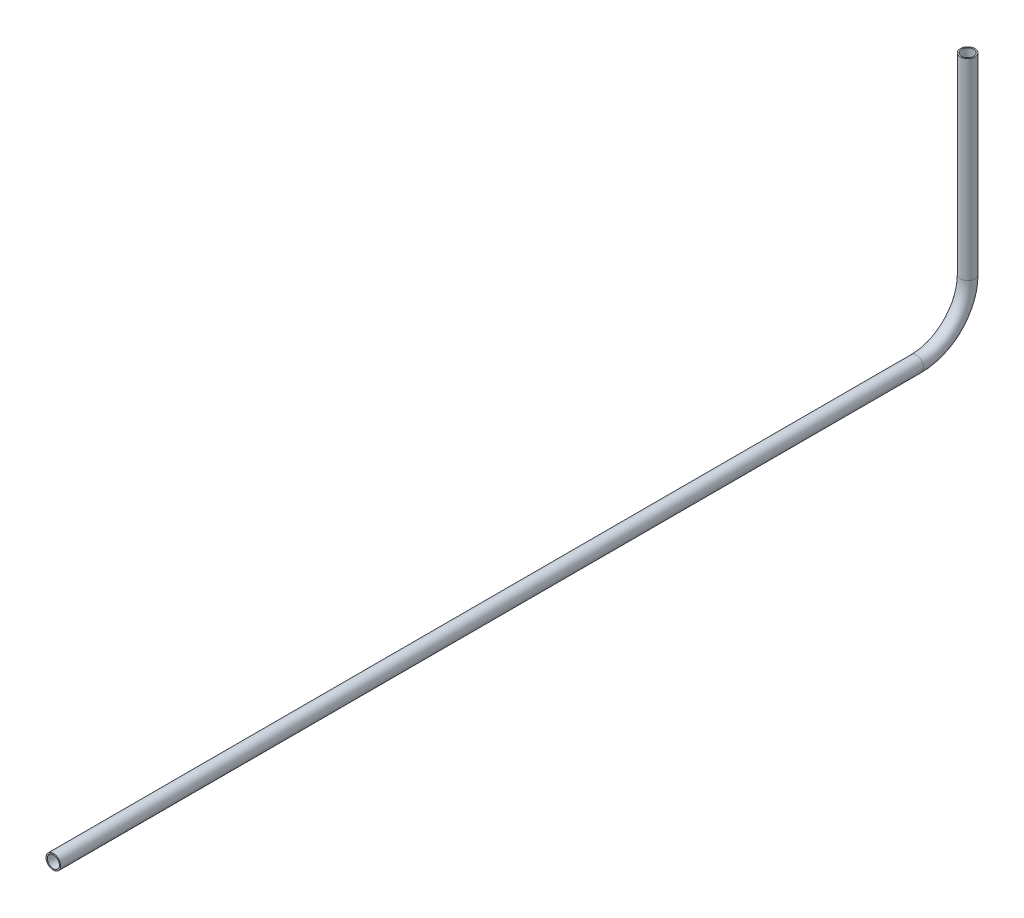
ISO-10303-21;
HEADER;
FILE_DESCRIPTION(('STEP AP214'),'2;1');
FILE_NAME('part.step','',(''),(''),'','','');
FILE_SCHEMA(('AUTOMOTIVE_DESIGN { 1 0 10303 214 1 1 1 1 }'));
ENDSEC;
DATA;
#1=APPLICATION_CONTEXT('core data for automotive mechanical design processes');
#2=APPLICATION_PROTOCOL_DEFINITION('international standard','automotive_design',2000,#1);
#3=PRODUCT_CONTEXT('',#1,'mechanical');
#4=PRODUCT('Part','Part','',(#3));
#5=PRODUCT_RELATED_PRODUCT_CATEGORY('part','',(#4));
#6=PRODUCT_DEFINITION_FORMATION('','',#4);
#7=PRODUCT_DEFINITION_CONTEXT('part definition',#1,'design');
#8=PRODUCT_DEFINITION('design','',#6,#7);
#9=PRODUCT_DEFINITION_SHAPE('','',#8);
#10=(LENGTH_UNIT() NAMED_UNIT(*) SI_UNIT(.MILLI.,.METRE.));
#11=(NAMED_UNIT(*) PLANE_ANGLE_UNIT() SI_UNIT($,.RADIAN.));
#12=(NAMED_UNIT(*) SI_UNIT($,.STERADIAN.) SOLID_ANGLE_UNIT());
#13=UNCERTAINTY_MEASURE_WITH_UNIT(LENGTH_MEASURE(1.E-05),#10,'distance_accuracy_value','');
#14=(GEOMETRIC_REPRESENTATION_CONTEXT(3) GLOBAL_UNCERTAINTY_ASSIGNED_CONTEXT((#13)) GLOBAL_UNIT_ASSIGNED_CONTEXT((#10,
#11,#12)) REPRESENTATION_CONTEXT('',''));
#15=CARTESIAN_POINT('',(0.,0.,0.));
#16=DIRECTION('',(0.,0.,1.));
#17=DIRECTION('',(1.,0.,0.));
#18=AXIS2_PLACEMENT_3D('',#15,#16,#17);
#19=CARTESIAN_POINT('',(0.,192.006959967836,-131.117091872553));
#20=DIRECTION('',(0.,0.,1.));
#21=DIRECTION('',(0.,-1.,0.));
#22=AXIS2_PLACEMENT_3D('',#19,#20,#21);
#23=CYLINDRICAL_SURFACE('',#22,2.61619999999999);
#24=CARTESIAN_POINT('',(0.,192.006959967836,242.917619127408));
#25=DIRECTION('',(0.,0.,-1.));
#26=DIRECTION('',(0.,1.,0.));
#27=AXIS2_PLACEMENT_3D('',#24,#25,#26);
#28=CIRCLE('',#27,2.61619999999999);
#29=CARTESIAN_POINT('',(0.,194.623159967836,242.917619127408));
#30=VERTEX_POINT('',#29);
#31=EDGE_CURVE('E55',#30,#30,#28,.T.);
#32=ORIENTED_EDGE('',*,*,#31,.F.);
#33=EDGE_LOOP('',(#32));
#34=FACE_BOUND('',#33,.T.);
#35=CARTESIAN_POINT('',(0.,192.006959967836,-131.117091872553));
#36=DIRECTION('',(0.,0.,-1.));
#37=DIRECTION('',(0.,1.,0.));
#38=AXIS2_PLACEMENT_3D('',#35,#36,#37);
#39=CIRCLE('',#38,2.61619999999999);
#40=CARTESIAN_POINT('',(0.,194.623159967836,-131.117091872553));
#41=VERTEX_POINT('',#40);
#42=EDGE_CURVE('E51',#41,#41,#39,.T.);
#43=ORIENTED_EDGE('',*,*,#42,.T.);
#44=EDGE_LOOP('',(#43));
#45=FACE_BOUND('',#44,.T.);
#46=ADVANCED_FACE('F47',(#34,#45),#23,.F.);
#47=CARTESIAN_POINT('',(0.,192.006959967836,-131.117091872553));
#48=DIRECTION('',(0.,0.,1.));
#49=DIRECTION('',(0.,-1.,0.));
#50=AXIS2_PLACEMENT_3D('',#47,#48,#49);
#51=CYLINDRICAL_SURFACE('',#50,3.175);
#52=CARTESIAN_POINT('',(0.,192.006959967836,242.917619127408));
#53=DIRECTION('',(0.,0.,-1.));
#54=DIRECTION('',(0.,1.,0.));
#55=AXIS2_PLACEMENT_3D('',#52,#53,#54);
#56=CIRCLE('',#55,3.175);
#57=CARTESIAN_POINT('',(0.,195.181959967836,242.917619127408));
#58=VERTEX_POINT('',#57);
#59=EDGE_CURVE('E59',#58,#58,#56,.T.);
#60=ORIENTED_EDGE('',*,*,#59,.T.);
#61=EDGE_LOOP('',(#60));
#62=FACE_BOUND('',#61,.T.);
#63=CARTESIAN_POINT('',(0.,192.006959967836,-131.117091872553));
#64=DIRECTION('',(0.,0.,-1.));
#65=DIRECTION('',(0.,1.,0.));
#66=AXIS2_PLACEMENT_3D('',#63,#64,#65);
#67=CIRCLE('',#66,3.175);
#68=CARTESIAN_POINT('',(0.,195.181959967836,-131.117091872553));
#69=VERTEX_POINT('',#68);
#70=EDGE_CURVE('E12',#69,#69,#67,.T.);
#71=ORIENTED_EDGE('',*,*,#70,.F.);
#72=EDGE_LOOP('',(#71));
#73=FACE_BOUND('',#72,.T.);
#74=ADVANCED_FACE('F74',(#62,#73),#51,.T.);
#75=CARTESIAN_POINT('',(0.,192.006959967836,242.917619127408));
#76=DIRECTION('',(0.,0.,-1.));
#77=DIRECTION('',(0.,1.,0.));
#78=AXIS2_PLACEMENT_3D('',#75,#76,#77);
#79=PLANE('',#78);
#80=ORIENTED_EDGE('',*,*,#31,.T.);
#81=EDGE_LOOP('',(#80));
#82=FACE_BOUND('',#81,.T.);
#83=ORIENTED_EDGE('',*,*,#59,.F.);
#84=EDGE_LOOP('',(#83));
#85=FACE_BOUND('',#84,.T.);
#86=ADVANCED_FACE('F70',(#82,#85),#79,.F.);
#87=CARTESIAN_POINT('',(0.,192.006959967836,-131.117091872553));
#88=DIRECTION('',(0.,0.,-1.));
#89=DIRECTION('',(0.,1.,0.));
#90=AXIS2_PLACEMENT_3D('',#87,#88,#89);
#91=PLANE('',#90);
#92=ORIENTED_EDGE('',*,*,#42,.F.);
#93=EDGE_LOOP('',(#92));
#94=FACE_BOUND('',#93,.T.);
#95=ORIENTED_EDGE('',*,*,#70,.T.);
#96=EDGE_LOOP('',(#95));
#97=FACE_BOUND('',#96,.T.);
#98=ADVANCED_FACE('F49',(#94,#97),#91,.T.);
#99=CLOSED_SHELL('',(#46,#74,#86,#98));
#100=MANIFOLD_SOLID_BREP('B2',#99);
#101=CARTESIAN_POINT('',(0.,214.231959967836,-131.117091872553));
#102=DIRECTION('',(-1.,0.,0.));
#103=DIRECTION('',(0.,0.,1.));
#104=AXIS2_PLACEMENT_3D('',#101,#102,#103);
#105=TOROIDAL_SURFACE('',#104,22.225,2.61619999999999);
#106=CARTESIAN_POINT('',(0.,214.231959967836,-153.342091872553));
#107=DIRECTION('',(0.,1.,0.));
#108=DIRECTION('',(0.,0.,1.));
#109=AXIS2_PLACEMENT_3D('',#106,#107,#108);
#110=CIRCLE('',#109,2.61619999999999);
#111=CARTESIAN_POINT('',(0.,214.231959967836,-155.958291872553));
#112=VERTEX_POINT('',#111);
#113=EDGE_CURVE('E150',#112,#112,#110,.T.);
#114=CARTESIAN_POINT('',(0.,192.006959967836,-131.117091872553));
#115=DIRECTION('',(0.,0.,1.));
#116=DIRECTION('',(0.,-1.,0.));
#117=AXIS2_PLACEMENT_3D('',#114,#115,#116);
#118=CIRCLE('',#117,2.61619999999999);
#119=CARTESIAN_POINT('',(0.,189.390759967836,-131.117091872553));
#120=VERTEX_POINT('',#119);
#121=EDGE_CURVE('E140',#120,#120,#118,.T.);
#122=CARTESIAN_POINT('',(0.,214.231959967836,-131.117091872553));
#123=DIRECTION('',(-1.,0.,0.));
#124=DIRECTION('',(0.,0.,1.));
#125=AXIS2_PLACEMENT_3D('',#122,#123,#124);
#126=CIRCLE('',#125,24.8412);
#127=EDGE_CURVE('',#112,#120,#126,.T.);
#128=ORIENTED_EDGE('',*,*,#113,.T.);
#129=ORIENTED_EDGE('',*,*,#121,.T.);
#130=ORIENTED_EDGE('',*,*,#127,.T.);
#131=ORIENTED_EDGE('',*,*,#127,.F.);
#132=EDGE_LOOP('',(#128,#130,#129,#131));
#133=FACE_BOUND('',#132,.T.);
#134=ADVANCED_FACE('F136',(#133),#105,.F.);
#135=CARTESIAN_POINT('',(0.,214.231959967836,-131.117091872553));
#136=DIRECTION('',(-1.,0.,0.));
#137=DIRECTION('',(0.,0.,1.));
#138=AXIS2_PLACEMENT_3D('',#135,#136,#137);
#139=TOROIDAL_SURFACE('',#138,22.225,3.175);
#140=CARTESIAN_POINT('',(0.,214.231959967836,-153.342091872553));
#141=DIRECTION('',(0.,1.,0.));
#142=DIRECTION('',(0.,0.,1.));
#143=AXIS2_PLACEMENT_3D('',#140,#141,#142);
#144=CIRCLE('',#143,3.175);
#145=CARTESIAN_POINT('',(0.,214.231959967836,-156.517091872553));
#146=VERTEX_POINT('',#145);
#147=EDGE_CURVE('E144',#146,#146,#144,.T.);
#148=CARTESIAN_POINT('',(0.,192.006959967836,-131.117091872553));
#149=DIRECTION('',(0.,0.,1.));
#150=DIRECTION('',(0.,-1.,0.));
#151=AXIS2_PLACEMENT_3D('',#148,#149,#150);
#152=CIRCLE('',#151,3.175);
#153=CARTESIAN_POINT('',(0.,188.831959967836,-131.117091872553));
#154=VERTEX_POINT('',#153);
#155=EDGE_CURVE('E46',#154,#154,#152,.T.);
#156=CARTESIAN_POINT('',(0.,214.231959967836,-131.117091872553));
#157=DIRECTION('',(-1.,0.,0.));
#158=DIRECTION('',(0.,0.,1.));
#159=AXIS2_PLACEMENT_3D('',#156,#157,#158);
#160=CIRCLE('',#159,25.4);
#161=EDGE_CURVE('',#146,#154,#160,.T.);
#162=ORIENTED_EDGE('',*,*,#147,.F.);
#163=ORIENTED_EDGE('',*,*,#155,.F.);
#164=ORIENTED_EDGE('',*,*,#161,.T.);
#165=ORIENTED_EDGE('',*,*,#161,.F.);
#166=EDGE_LOOP('',(#162,#164,#163,#165));
#167=FACE_BOUND('',#166,.T.);
#168=ADVANCED_FACE('F163',(#167),#139,.T.);
#169=CARTESIAN_POINT('',(0.,214.231959967836,-153.342091872553));
#170=DIRECTION('',(0.,1.,0.));
#171=DIRECTION('',(0.,0.,1.));
#172=AXIS2_PLACEMENT_3D('',#169,#170,#171);
#173=PLANE('',#172);
#174=ORIENTED_EDGE('',*,*,#113,.F.);
#175=EDGE_LOOP('',(#174));
#176=FACE_BOUND('',#175,.T.);
#177=ORIENTED_EDGE('',*,*,#147,.T.);
#178=EDGE_LOOP('',(#177));
#179=FACE_BOUND('',#178,.T.);
#180=ADVANCED_FACE('F159',(#176,#179),#173,.T.);
#181=CARTESIAN_POINT('',(0.,192.006959967836,-131.117091872553));
#182=DIRECTION('',(0.,0.,1.));
#183=DIRECTION('',(0.,-1.,0.));
#184=AXIS2_PLACEMENT_3D('',#181,#182,#183);
#185=PLANE('',#184);
#186=ORIENTED_EDGE('',*,*,#121,.F.);
#187=EDGE_LOOP('',(#186));
#188=FACE_BOUND('',#187,.T.);
#189=ORIENTED_EDGE('',*,*,#155,.T.);
#190=EDGE_LOOP('',(#189));
#191=FACE_BOUND('',#190,.T.);
#192=ADVANCED_FACE('F138',(#188,#191),#185,.T.);
#193=CLOSED_SHELL('',(#134,#168,#180,#192));
#194=MANIFOLD_SOLID_BREP('B7',#193);
#195=CARTESIAN_POINT('',(0.,297.527925577302,-153.342091872553));
#196=DIRECTION('',(0.,-1.,0.));
#197=DIRECTION('',(0.,0.,-1.));
#198=AXIS2_PLACEMENT_3D('',#195,#196,#197);
#199=CYLINDRICAL_SURFACE('',#198,2.61619999999999);
#200=CARTESIAN_POINT('',(0.,297.527925577302,-153.342091872553));
#201=DIRECTION('',(0.,1.,0.));
#202=DIRECTION('',(0.,0.,1.));
#203=AXIS2_PLACEMENT_3D('',#200,#201,#202);
#204=CIRCLE('',#203,2.61619999999999);
#205=CARTESIAN_POINT('',(0.,297.527925577302,-150.725891872553));
#206=VERTEX_POINT('',#205);
#207=EDGE_CURVE('E234',#206,#206,#204,.T.);
#208=ORIENTED_EDGE('',*,*,#207,.T.);
#209=EDGE_LOOP('',(#208));
#210=FACE_BOUND('',#209,.T.);
#211=CARTESIAN_POINT('',(0.,214.231959967836,-153.342091872553));
#212=DIRECTION('',(0.,-1.,0.));
#213=DIRECTION('',(0.,0.,-1.));
#214=AXIS2_PLACEMENT_3D('',#211,#212,#213);
#215=CIRCLE('',#214,2.61619999999999);
#216=CARTESIAN_POINT('',(0.,214.231959967836,-155.958291872553));
#217=VERTEX_POINT('',#216);
#218=EDGE_CURVE('E224',#217,#217,#215,.T.);
#219=ORIENTED_EDGE('',*,*,#218,.T.);
#220=EDGE_LOOP('',(#219));
#221=FACE_BOUND('',#220,.T.);
#222=ADVANCED_FACE('F220',(#210,#221),#199,.F.);
#223=CARTESIAN_POINT('',(0.,297.527925577302,-153.342091872553));
#224=DIRECTION('',(0.,-1.,0.));
#225=DIRECTION('',(0.,0.,-1.));
#226=AXIS2_PLACEMENT_3D('',#223,#224,#225);
#227=CYLINDRICAL_SURFACE('',#226,3.175);
#228=CARTESIAN_POINT('',(0.,297.527925577302,-153.342091872553));
#229=DIRECTION('',(0.,1.,0.));
#230=DIRECTION('',(0.,0.,1.));
#231=AXIS2_PLACEMENT_3D('',#228,#229,#230);
#232=CIRCLE('',#231,3.175);
#233=CARTESIAN_POINT('',(0.,297.527925577302,-150.167091872553));
#234=VERTEX_POINT('',#233);
#235=EDGE_CURVE('E228',#234,#234,#232,.T.);
#236=ORIENTED_EDGE('',*,*,#235,.F.);
#237=EDGE_LOOP('',(#236));
#238=FACE_BOUND('',#237,.T.);
#239=CARTESIAN_POINT('',(0.,214.231959967836,-153.342091872553));
#240=DIRECTION('',(0.,-1.,0.));
#241=DIRECTION('',(0.,0.,-1.));
#242=AXIS2_PLACEMENT_3D('',#239,#240,#241);
#243=CIRCLE('',#242,3.175);
#244=CARTESIAN_POINT('',(0.,214.231959967836,-156.517091872553));
#245=VERTEX_POINT('',#244);
#246=EDGE_CURVE('E135',#245,#245,#243,.T.);
#247=ORIENTED_EDGE('',*,*,#246,.F.);
#248=EDGE_LOOP('',(#247));
#249=FACE_BOUND('',#248,.T.);
#250=ADVANCED_FACE('F247',(#238,#249),#227,.T.);
#251=CARTESIAN_POINT('',(0.,297.527925577302,-153.342091872553));
#252=DIRECTION('',(0.,1.,0.));
#253=DIRECTION('',(0.,0.,1.));
#254=AXIS2_PLACEMENT_3D('',#251,#252,#253);
#255=PLANE('',#254);
#256=ORIENTED_EDGE('',*,*,#207,.F.);
#257=EDGE_LOOP('',(#256));
#258=FACE_BOUND('',#257,.T.);
#259=ORIENTED_EDGE('',*,*,#235,.T.);
#260=EDGE_LOOP('',(#259));
#261=FACE_BOUND('',#260,.T.);
#262=ADVANCED_FACE('F243',(#258,#261),#255,.T.);
#263=CARTESIAN_POINT('',(0.,214.231959967836,-153.342091872553));
#264=DIRECTION('',(0.,-1.,0.));
#265=DIRECTION('',(0.,0.,-1.));
#266=AXIS2_PLACEMENT_3D('',#263,#264,#265);
#267=PLANE('',#266);
#268=ORIENTED_EDGE('',*,*,#218,.F.);
#269=EDGE_LOOP('',(#268));
#270=FACE_BOUND('',#269,.T.);
#271=ORIENTED_EDGE('',*,*,#246,.T.);
#272=EDGE_LOOP('',(#271));
#273=FACE_BOUND('',#272,.T.);
#274=ADVANCED_FACE('F222',(#270,#273),#267,.T.);
#275=CLOSED_SHELL('',(#222,#250,#262,#274));
#276=MANIFOLD_SOLID_BREP('B41',#275);
#277=ADVANCED_BREP_SHAPE_REPRESENTATION('',(#18,#100,#194,#276),#14);
#278=SHAPE_DEFINITION_REPRESENTATION(#9,#277);
ENDSEC;
END-ISO-10303-21;
